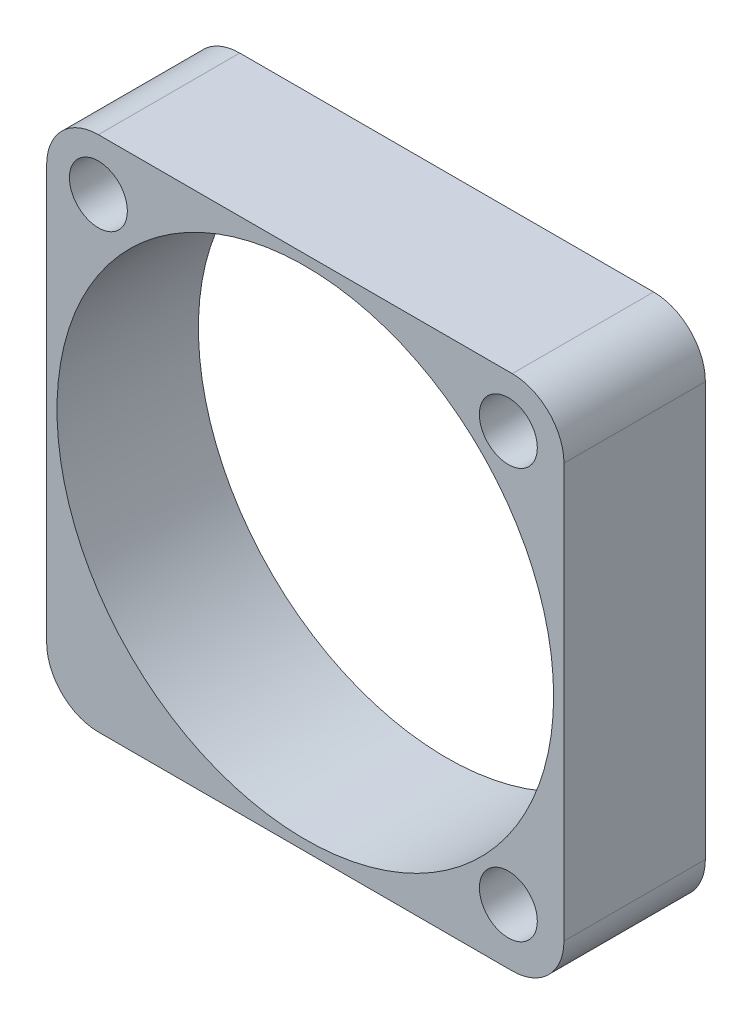
ISO-10303-21;
HEADER;
FILE_DESCRIPTION(('STEP AP214'),'2;1');
FILE_NAME('part.step','',(''),(''),'','','');
FILE_SCHEMA(('AUTOMOTIVE_DESIGN { 1 0 10303 214 1 1 1 1 }'));
ENDSEC;
DATA;
#1=APPLICATION_CONTEXT('core data for automotive mechanical design processes');
#2=APPLICATION_PROTOCOL_DEFINITION('international standard','automotive_design',2000,#1);
#3=PRODUCT_CONTEXT('',#1,'mechanical');
#4=PRODUCT('Part','Part','',(#3));
#5=PRODUCT_RELATED_PRODUCT_CATEGORY('part','',(#4));
#6=PRODUCT_DEFINITION_FORMATION('','',#4);
#7=PRODUCT_DEFINITION_CONTEXT('part definition',#1,'design');
#8=PRODUCT_DEFINITION('design','',#6,#7);
#9=PRODUCT_DEFINITION_SHAPE('','',#8);
#10=(LENGTH_UNIT() NAMED_UNIT(*) SI_UNIT(.MILLI.,.METRE.));
#11=(NAMED_UNIT(*) PLANE_ANGLE_UNIT() SI_UNIT($,.RADIAN.));
#12=(NAMED_UNIT(*) SI_UNIT($,.STERADIAN.) SOLID_ANGLE_UNIT());
#13=UNCERTAINTY_MEASURE_WITH_UNIT(LENGTH_MEASURE(1.E-05),#10,'distance_accuracy_value','');
#14=(GEOMETRIC_REPRESENTATION_CONTEXT(3) GLOBAL_UNCERTAINTY_ASSIGNED_CONTEXT((#13)) GLOBAL_UNIT_ASSIGNED_CONTEXT((#10,
#11,#12)) REPRESENTATION_CONTEXT('',''));
#15=CARTESIAN_POINT('',(0.,0.,0.));
#16=DIRECTION('',(0.,0.,1.));
#17=DIRECTION('',(1.,0.,0.));
#18=AXIS2_PLACEMENT_3D('',#15,#16,#17);
#19=CARTESIAN_POINT('',(0.,0.,6.8325));
#20=DIRECTION('',(1.,0.,0.));
#21=DIRECTION('',(0.,0.,-1.));
#22=AXIS2_PLACEMENT_3D('',#19,#20,#21);
#23=PLANE('',#22);
#24=DIRECTION('',(0.,-1.,0.));
#25=VECTOR('',#24,1.);
#26=CARTESIAN_POINT('',(0.,0.,0.));
#27=LINE('',#26,#25);
#28=CARTESIAN_POINT('',(0.,22.5,0.));
#29=VERTEX_POINT('',#28);
#30=CARTESIAN_POINT('',(0.,2.5,0.));
#31=VERTEX_POINT('',#30);
#32=EDGE_CURVE('E125',#29,#31,#27,.T.);
#33=ORIENTED_EDGE('',*,*,#32,.T.);
#34=DIRECTION('',(0.,0.,-1.));
#35=VECTOR('',#34,1.);
#36=CARTESIAN_POINT('',(0.,2.5,6.8325));
#37=LINE('',#36,#35);
#38=CARTESIAN_POINT('',(0.,2.5,6.8325));
#39=VERTEX_POINT('',#38);
#40=EDGE_CURVE('E103',#31,#39,#37,.F.);
#41=ORIENTED_EDGE('',*,*,#40,.T.);
#42=DIRECTION('',(0.,-1.,0.));
#43=VECTOR('',#42,1.);
#44=CARTESIAN_POINT('',(0.,0.,6.8325));
#45=LINE('',#44,#43);
#46=CARTESIAN_POINT('',(0.,22.5,6.8325));
#47=VERTEX_POINT('',#46);
#48=EDGE_CURVE('E135',#47,#39,#45,.T.);
#49=ORIENTED_EDGE('',*,*,#48,.F.);
#50=DIRECTION('',(0.,0.,-1.));
#51=VECTOR('',#50,1.);
#52=CARTESIAN_POINT('',(0.,22.5,6.8325));
#53=LINE('',#52,#51);
#54=EDGE_CURVE('E108',#47,#29,#53,.T.);
#55=ORIENTED_EDGE('',*,*,#54,.T.);
#56=EDGE_LOOP('',(#33,#41,#49,#55));
#57=FACE_BOUND('',#56,.T.);
#58=ADVANCED_FACE('F32',(#57),#23,.F.);
#59=CARTESIAN_POINT('',(0.,0.,6.8325));
#60=DIRECTION('',(0.,1.,0.));
#61=DIRECTION('',(0.,0.,1.));
#62=AXIS2_PLACEMENT_3D('',#59,#60,#61);
#63=PLANE('',#62);
#64=DIRECTION('',(1.,0.,0.));
#65=VECTOR('',#64,1.);
#66=CARTESIAN_POINT('',(0.,0.,6.8325));
#67=LINE('',#66,#65);
#68=CARTESIAN_POINT('',(2.5,0.,6.8325));
#69=VERTEX_POINT('',#68);
#70=CARTESIAN_POINT('',(22.5,0.,6.8325));
#71=VERTEX_POINT('',#70);
#72=EDGE_CURVE('E118',#69,#71,#67,.T.);
#73=ORIENTED_EDGE('',*,*,#72,.F.);
#74=DIRECTION('',(0.,0.,-1.));
#75=VECTOR('',#74,1.);
#76=CARTESIAN_POINT('',(2.5,0.,6.8325));
#77=LINE('',#76,#75);
#78=CARTESIAN_POINT('',(2.5,0.,0.));
#79=VERTEX_POINT('',#78);
#80=EDGE_CURVE('E102',#69,#79,#77,.T.);
#81=ORIENTED_EDGE('',*,*,#80,.T.);
#82=DIRECTION('',(1.,0.,0.));
#83=VECTOR('',#82,1.);
#84=CARTESIAN_POINT('',(0.,0.,0.));
#85=LINE('',#84,#83);
#86=CARTESIAN_POINT('',(22.5,0.,0.));
#87=VERTEX_POINT('',#86);
#88=EDGE_CURVE('E115',#79,#87,#85,.T.);
#89=ORIENTED_EDGE('',*,*,#88,.T.);
#90=DIRECTION('',(0.,0.,-1.));
#91=VECTOR('',#90,1.);
#92=CARTESIAN_POINT('',(22.5,0.,6.8325));
#93=LINE('',#92,#91);
#94=EDGE_CURVE('E120',#87,#71,#93,.F.);
#95=ORIENTED_EDGE('',*,*,#94,.T.);
#96=EDGE_LOOP('',(#73,#81,#89,#95));
#97=FACE_BOUND('',#96,.T.);
#98=ADVANCED_FACE('F114',(#97),#63,.F.);
#99=CARTESIAN_POINT('',(25.,0.,6.8325));
#100=DIRECTION('',(-1.,0.,0.));
#101=DIRECTION('',(0.,0.,1.));
#102=AXIS2_PLACEMENT_3D('',#99,#100,#101);
#103=PLANE('',#102);
#104=DIRECTION('',(0.,1.,0.));
#105=VECTOR('',#104,1.);
#106=CARTESIAN_POINT('',(25.,0.,6.8325));
#107=LINE('',#106,#105);
#108=CARTESIAN_POINT('',(25.,2.5,6.8325));
#109=VERTEX_POINT('',#108);
#110=CARTESIAN_POINT('',(25.,22.5,6.8325));
#111=VERTEX_POINT('',#110);
#112=EDGE_CURVE('E161',#109,#111,#107,.T.);
#113=ORIENTED_EDGE('',*,*,#112,.F.);
#114=DIRECTION('',(0.,0.,-1.));
#115=VECTOR('',#114,1.);
#116=CARTESIAN_POINT('',(25.,2.5,6.8325));
#117=LINE('',#116,#115);
#118=CARTESIAN_POINT('',(25.,2.5,0.));
#119=VERTEX_POINT('',#118);
#120=EDGE_CURVE('E154',#109,#119,#117,.T.);
#121=ORIENTED_EDGE('',*,*,#120,.T.);
#122=DIRECTION('',(0.,1.,0.));
#123=VECTOR('',#122,1.);
#124=CARTESIAN_POINT('',(25.,0.,0.));
#125=LINE('',#124,#123);
#126=CARTESIAN_POINT('',(25.,22.5,0.));
#127=VERTEX_POINT('',#126);
#128=EDGE_CURVE('E124',#119,#127,#125,.T.);
#129=ORIENTED_EDGE('',*,*,#128,.T.);
#130=DIRECTION('',(0.,0.,-1.));
#131=VECTOR('',#130,1.);
#132=CARTESIAN_POINT('',(25.,22.5,6.8325));
#133=LINE('',#132,#131);
#134=EDGE_CURVE('E152',#127,#111,#133,.F.);
#135=ORIENTED_EDGE('',*,*,#134,.T.);
#136=EDGE_LOOP('',(#113,#121,#129,#135));
#137=FACE_BOUND('',#136,.T.);
#138=ADVANCED_FACE('F159',(#137),#103,.F.);
#139=CARTESIAN_POINT('',(0.,25.,6.8325));
#140=DIRECTION('',(0.,-1.,0.));
#141=DIRECTION('',(0.,0.,-1.));
#142=AXIS2_PLACEMENT_3D('',#139,#140,#141);
#143=PLANE('',#142);
#144=DIRECTION('',(-1.,0.,0.));
#145=VECTOR('',#144,1.);
#146=CARTESIAN_POINT('',(0.,25.,6.8325));
#147=LINE('',#146,#145);
#148=CARTESIAN_POINT('',(22.5,25.,6.8325));
#149=VERTEX_POINT('',#148);
#150=CARTESIAN_POINT('',(2.5,25.,6.8325));
#151=VERTEX_POINT('',#150);
#152=EDGE_CURVE('E136',#149,#151,#147,.T.);
#153=ORIENTED_EDGE('',*,*,#152,.F.);
#154=DIRECTION('',(0.,0.,-1.));
#155=VECTOR('',#154,1.);
#156=CARTESIAN_POINT('',(22.5,25.,6.8325));
#157=LINE('',#156,#155);
#158=CARTESIAN_POINT('',(22.5,25.,0.));
#159=VERTEX_POINT('',#158);
#160=EDGE_CURVE('E11',#149,#159,#157,.T.);
#161=ORIENTED_EDGE('',*,*,#160,.T.);
#162=DIRECTION('',(-1.,0.,0.));
#163=VECTOR('',#162,1.);
#164=CARTESIAN_POINT('',(0.,25.,0.));
#165=LINE('',#164,#163);
#166=CARTESIAN_POINT('',(2.5,25.,0.));
#167=VERTEX_POINT('',#166);
#168=EDGE_CURVE('E128',#159,#167,#165,.T.);
#169=ORIENTED_EDGE('',*,*,#168,.T.);
#170=DIRECTION('',(0.,0.,-1.));
#171=VECTOR('',#170,1.);
#172=CARTESIAN_POINT('',(2.5,25.,6.8325));
#173=LINE('',#172,#171);
#174=EDGE_CURVE('E40',#167,#151,#173,.F.);
#175=ORIENTED_EDGE('',*,*,#174,.T.);
#176=EDGE_LOOP('',(#153,#161,#169,#175));
#177=FACE_BOUND('',#176,.T.);
#178=ADVANCED_FACE('F168',(#177),#143,.F.);
#179=CARTESIAN_POINT('',(0.,0.,6.8325));
#180=DIRECTION('',(0.,0.,-1.));
#181=DIRECTION('',(-1.,0.,0.));
#182=AXIS2_PLACEMENT_3D('',#179,#180,#181);
#183=PLANE('',#182);
#184=CARTESIAN_POINT('',(22.312,2.68799999999999,6.8325));
#185=DIRECTION('',(0.,0.,1.));
#186=DIRECTION('',(1.,0.,0.));
#187=AXIS2_PLACEMENT_3D('',#184,#185,#186);
#188=CIRCLE('',#187,1.4);
#189=CARTESIAN_POINT('',(23.712,2.68799999999999,6.8325));
#190=VERTEX_POINT('',#189);
#191=EDGE_CURVE('E193',#190,#190,#188,.T.);
#192=ORIENTED_EDGE('',*,*,#191,.F.);
#193=EDGE_LOOP('',(#192));
#194=FACE_BOUND('',#193,.T.);
#195=CARTESIAN_POINT('',(22.312,22.5,6.8325));
#196=DIRECTION('',(0.,0.,1.));
#197=DIRECTION('',(1.,0.,0.));
#198=AXIS2_PLACEMENT_3D('',#195,#196,#197);
#199=CIRCLE('',#198,1.4);
#200=CARTESIAN_POINT('',(23.712,22.5,6.8325));
#201=VERTEX_POINT('',#200);
#202=EDGE_CURVE('E187',#201,#201,#199,.T.);
#203=ORIENTED_EDGE('',*,*,#202,.F.);
#204=EDGE_LOOP('',(#203));
#205=FACE_BOUND('',#204,.T.);
#206=CARTESIAN_POINT('',(2.5,22.5,6.8325));
#207=DIRECTION('',(0.,0.,1.));
#208=DIRECTION('',(1.,0.,0.));
#209=AXIS2_PLACEMENT_3D('',#206,#207,#208);
#210=CIRCLE('',#209,1.4);
#211=CARTESIAN_POINT('',(3.9,22.5,6.8325));
#212=VERTEX_POINT('',#211);
#213=EDGE_CURVE('E181',#212,#212,#210,.T.);
#214=ORIENTED_EDGE('',*,*,#213,.F.);
#215=EDGE_LOOP('',(#214));
#216=FACE_BOUND('',#215,.T.);
#217=CARTESIAN_POINT('',(12.5,12.5,6.8325));
#218=DIRECTION('',(0.,0.,1.));
#219=DIRECTION('',(1.,0.,0.));
#220=AXIS2_PLACEMENT_3D('',#217,#218,#219);
#221=CIRCLE('',#220,12.);
#222=CARTESIAN_POINT('',(24.5,12.5,6.8325));
#223=VERTEX_POINT('',#222);
#224=EDGE_CURVE('E175',#223,#223,#221,.T.);
#225=ORIENTED_EDGE('',*,*,#224,.F.);
#226=EDGE_LOOP('',(#225));
#227=FACE_BOUND('',#226,.T.);
#228=ORIENTED_EDGE('',*,*,#48,.T.);
#229=CARTESIAN_POINT('',(2.5,2.5,6.8325));
#230=DIRECTION('',(0.,0.,-1.));
#231=DIRECTION('',(-1.,0.,0.));
#232=AXIS2_PLACEMENT_3D('',#229,#230,#231);
#233=CIRCLE('',#232,2.5);
#234=EDGE_CURVE('E150',#39,#69,#233,.F.);
#235=ORIENTED_EDGE('',*,*,#234,.T.);
#236=ORIENTED_EDGE('',*,*,#72,.T.);
#237=CARTESIAN_POINT('',(22.5,2.5,6.8325));
#238=DIRECTION('',(0.,0.,-1.));
#239=DIRECTION('',(-1.,0.,0.));
#240=AXIS2_PLACEMENT_3D('',#237,#238,#239);
#241=CIRCLE('',#240,2.5);
#242=EDGE_CURVE('E148',#71,#109,#241,.F.);
#243=ORIENTED_EDGE('',*,*,#242,.T.);
#244=ORIENTED_EDGE('',*,*,#112,.T.);
#245=CARTESIAN_POINT('',(22.5,22.5,6.8325));
#246=DIRECTION('',(0.,0.,-1.));
#247=DIRECTION('',(-1.,0.,0.));
#248=AXIS2_PLACEMENT_3D('',#245,#246,#247);
#249=CIRCLE('',#248,2.5);
#250=EDGE_CURVE('E53',#111,#149,#249,.F.);
#251=ORIENTED_EDGE('',*,*,#250,.T.);
#252=ORIENTED_EDGE('',*,*,#152,.T.);
#253=CARTESIAN_POINT('',(2.5,22.5,6.8325));
#254=DIRECTION('',(0.,0.,-1.));
#255=DIRECTION('',(-1.,0.,0.));
#256=AXIS2_PLACEMENT_3D('',#253,#254,#255);
#257=CIRCLE('',#256,2.5);
#258=EDGE_CURVE('E145',#151,#47,#257,.F.);
#259=ORIENTED_EDGE('',*,*,#258,.T.);
#260=EDGE_LOOP('',(#228,#235,#236,#243,#244,#251,#252,#259));
#261=FACE_BOUND('',#260,.T.);
#262=ADVANCED_FACE('F208',(#194,#205,#216,#227,#261),#183,.F.);
#263=CARTESIAN_POINT('',(0.,0.,0.));
#264=DIRECTION('',(0.,0.,-1.));
#265=DIRECTION('',(-1.,0.,0.));
#266=AXIS2_PLACEMENT_3D('',#263,#264,#265);
#267=PLANE('',#266);
#268=CARTESIAN_POINT('',(22.312,2.68799999999999,0.));
#269=DIRECTION('',(0.,0.,1.));
#270=DIRECTION('',(1.,0.,0.));
#271=AXIS2_PLACEMENT_3D('',#268,#269,#270);
#272=CIRCLE('',#271,1.4);
#273=CARTESIAN_POINT('',(23.712,2.68799999999999,0.));
#274=VERTEX_POINT('',#273);
#275=EDGE_CURVE('E190',#274,#274,#272,.T.);
#276=ORIENTED_EDGE('',*,*,#275,.T.);
#277=EDGE_LOOP('',(#276));
#278=FACE_BOUND('',#277,.T.);
#279=CARTESIAN_POINT('',(22.312,22.5,0.));
#280=DIRECTION('',(0.,0.,1.));
#281=DIRECTION('',(1.,0.,0.));
#282=AXIS2_PLACEMENT_3D('',#279,#280,#281);
#283=CIRCLE('',#282,1.4);
#284=CARTESIAN_POINT('',(23.712,22.5,0.));
#285=VERTEX_POINT('',#284);
#286=EDGE_CURVE('E184',#285,#285,#283,.T.);
#287=ORIENTED_EDGE('',*,*,#286,.T.);
#288=EDGE_LOOP('',(#287));
#289=FACE_BOUND('',#288,.T.);
#290=CARTESIAN_POINT('',(2.5,22.5,0.));
#291=DIRECTION('',(0.,0.,1.));
#292=DIRECTION('',(1.,0.,0.));
#293=AXIS2_PLACEMENT_3D('',#290,#291,#292);
#294=CIRCLE('',#293,1.4);
#295=CARTESIAN_POINT('',(3.9,22.5,0.));
#296=VERTEX_POINT('',#295);
#297=EDGE_CURVE('E178',#296,#296,#294,.T.);
#298=ORIENTED_EDGE('',*,*,#297,.T.);
#299=EDGE_LOOP('',(#298));
#300=FACE_BOUND('',#299,.T.);
#301=CARTESIAN_POINT('',(12.5,12.5,0.));
#302=DIRECTION('',(0.,0.,1.));
#303=DIRECTION('',(1.,0.,0.));
#304=AXIS2_PLACEMENT_3D('',#301,#302,#303);
#305=CIRCLE('',#304,12.);
#306=CARTESIAN_POINT('',(24.5,12.5,0.));
#307=VERTEX_POINT('',#306);
#308=EDGE_CURVE('E130',#307,#307,#305,.T.);
#309=ORIENTED_EDGE('',*,*,#308,.T.);
#310=EDGE_LOOP('',(#309));
#311=FACE_BOUND('',#310,.T.);
#312=ORIENTED_EDGE('',*,*,#88,.F.);
#313=CARTESIAN_POINT('',(2.5,2.5,0.));
#314=DIRECTION('',(0.,0.,-1.));
#315=DIRECTION('',(-1.,0.,0.));
#316=AXIS2_PLACEMENT_3D('',#313,#314,#315);
#317=CIRCLE('',#316,2.5);
#318=EDGE_CURVE('E98',#79,#31,#317,.T.);
#319=ORIENTED_EDGE('',*,*,#318,.T.);
#320=ORIENTED_EDGE('',*,*,#32,.F.);
#321=CARTESIAN_POINT('',(2.5,22.5,0.));
#322=DIRECTION('',(0.,0.,-1.));
#323=DIRECTION('',(-1.,0.,0.));
#324=AXIS2_PLACEMENT_3D('',#321,#322,#323);
#325=CIRCLE('',#324,2.5);
#326=EDGE_CURVE('E119',#29,#167,#325,.T.);
#327=ORIENTED_EDGE('',*,*,#326,.T.);
#328=ORIENTED_EDGE('',*,*,#168,.F.);
#329=CARTESIAN_POINT('',(22.5,22.5,0.));
#330=DIRECTION('',(0.,0.,-1.));
#331=DIRECTION('',(-1.,0.,0.));
#332=AXIS2_PLACEMENT_3D('',#329,#330,#331);
#333=CIRCLE('',#332,2.5);
#334=EDGE_CURVE('E139',#159,#127,#333,.T.);
#335=ORIENTED_EDGE('',*,*,#334,.T.);
#336=ORIENTED_EDGE('',*,*,#128,.F.);
#337=CARTESIAN_POINT('',(22.5,2.5,0.));
#338=DIRECTION('',(0.,0.,-1.));
#339=DIRECTION('',(-1.,0.,0.));
#340=AXIS2_PLACEMENT_3D('',#337,#338,#339);
#341=CIRCLE('',#340,2.5);
#342=EDGE_CURVE('E109',#119,#87,#341,.T.);
#343=ORIENTED_EDGE('',*,*,#342,.T.);
#344=EDGE_LOOP('',(#312,#319,#320,#327,#328,#335,#336,#343));
#345=FACE_BOUND('',#344,.T.);
#346=ADVANCED_FACE('F122',(#278,#289,#300,#311,#345),#267,.T.);
#347=CARTESIAN_POINT('',(12.5,12.5,0.));
#348=DIRECTION('',(0.,0.,1.));
#349=DIRECTION('',(1.,0.,0.));
#350=AXIS2_PLACEMENT_3D('',#347,#348,#349);
#351=CYLINDRICAL_SURFACE('',#350,12.);
#352=ORIENTED_EDGE('',*,*,#308,.F.);
#353=EDGE_LOOP('',(#352));
#354=FACE_BOUND('',#353,.T.);
#355=ORIENTED_EDGE('',*,*,#224,.T.);
#356=EDGE_LOOP('',(#355));
#357=FACE_BOUND('',#356,.T.);
#358=ADVANCED_FACE('F280',(#354,#357),#351,.F.);
#359=CARTESIAN_POINT('',(2.5,22.5,0.));
#360=DIRECTION('',(0.,0.,1.));
#361=DIRECTION('',(1.,0.,0.));
#362=AXIS2_PLACEMENT_3D('',#359,#360,#361);
#363=CYLINDRICAL_SURFACE('',#362,1.4);
#364=ORIENTED_EDGE('',*,*,#297,.F.);
#365=EDGE_LOOP('',(#364));
#366=FACE_BOUND('',#365,.T.);
#367=ORIENTED_EDGE('',*,*,#213,.T.);
#368=EDGE_LOOP('',(#367));
#369=FACE_BOUND('',#368,.T.);
#370=ADVANCED_FACE('F271',(#366,#369),#363,.F.);
#371=CARTESIAN_POINT('',(22.312,22.5,0.));
#372=DIRECTION('',(0.,0.,1.));
#373=DIRECTION('',(1.,0.,0.));
#374=AXIS2_PLACEMENT_3D('',#371,#372,#373);
#375=CYLINDRICAL_SURFACE('',#374,1.4);
#376=ORIENTED_EDGE('',*,*,#286,.F.);
#377=EDGE_LOOP('',(#376));
#378=FACE_BOUND('',#377,.T.);
#379=ORIENTED_EDGE('',*,*,#202,.T.);
#380=EDGE_LOOP('',(#379));
#381=FACE_BOUND('',#380,.T.);
#382=ADVANCED_FACE('F204',(#378,#381),#375,.F.);
#383=CARTESIAN_POINT('',(22.312,2.68799999999999,0.));
#384=DIRECTION('',(0.,0.,1.));
#385=DIRECTION('',(1.,0.,0.));
#386=AXIS2_PLACEMENT_3D('',#383,#384,#385);
#387=CYLINDRICAL_SURFACE('',#386,1.4);
#388=ORIENTED_EDGE('',*,*,#275,.F.);
#389=EDGE_LOOP('',(#388));
#390=FACE_BOUND('',#389,.T.);
#391=ORIENTED_EDGE('',*,*,#191,.T.);
#392=EDGE_LOOP('',(#391));
#393=FACE_BOUND('',#392,.T.);
#394=ADVANCED_FACE('F201',(#390,#393),#387,.F.);
#395=CARTESIAN_POINT('',(2.5,2.5,6.8325));
#396=DIRECTION('',(0.,0.,-1.));
#397=DIRECTION('',(-1.,0.,0.));
#398=AXIS2_PLACEMENT_3D('',#395,#396,#397);
#399=CYLINDRICAL_SURFACE('',#398,2.5);
#400=ORIENTED_EDGE('',*,*,#234,.F.);
#401=ORIENTED_EDGE('',*,*,#40,.F.);
#402=ORIENTED_EDGE('',*,*,#318,.F.);
#403=ORIENTED_EDGE('',*,*,#80,.F.);
#404=EDGE_LOOP('',(#400,#401,#402,#403));
#405=FACE_BOUND('',#404,.T.);
#406=ADVANCED_FACE('F101',(#405),#399,.T.);
#407=CARTESIAN_POINT('',(22.5,2.5,6.8325));
#408=DIRECTION('',(0.,0.,-1.));
#409=DIRECTION('',(-1.,0.,0.));
#410=AXIS2_PLACEMENT_3D('',#407,#408,#409);
#411=CYLINDRICAL_SURFACE('',#410,2.5);
#412=ORIENTED_EDGE('',*,*,#242,.F.);
#413=ORIENTED_EDGE('',*,*,#94,.F.);
#414=ORIENTED_EDGE('',*,*,#342,.F.);
#415=ORIENTED_EDGE('',*,*,#120,.F.);
#416=EDGE_LOOP('',(#412,#413,#414,#415));
#417=FACE_BOUND('',#416,.T.);
#418=ADVANCED_FACE('F225',(#417),#411,.T.);
#419=CARTESIAN_POINT('',(22.5,22.5,6.8325));
#420=DIRECTION('',(0.,0.,-1.));
#421=DIRECTION('',(-1.,0.,0.));
#422=AXIS2_PLACEMENT_3D('',#419,#420,#421);
#423=CYLINDRICAL_SURFACE('',#422,2.5);
#424=ORIENTED_EDGE('',*,*,#250,.F.);
#425=ORIENTED_EDGE('',*,*,#134,.F.);
#426=ORIENTED_EDGE('',*,*,#334,.F.);
#427=ORIENTED_EDGE('',*,*,#160,.F.);
#428=EDGE_LOOP('',(#424,#425,#426,#427));
#429=FACE_BOUND('',#428,.T.);
#430=ADVANCED_FACE('F167',(#429),#423,.T.);
#431=CARTESIAN_POINT('',(2.5,22.5,6.8325));
#432=DIRECTION('',(0.,0.,-1.));
#433=DIRECTION('',(-1.,0.,0.));
#434=AXIS2_PLACEMENT_3D('',#431,#432,#433);
#435=CYLINDRICAL_SURFACE('',#434,2.5);
#436=ORIENTED_EDGE('',*,*,#258,.F.);
#437=ORIENTED_EDGE('',*,*,#174,.F.);
#438=ORIENTED_EDGE('',*,*,#326,.F.);
#439=ORIENTED_EDGE('',*,*,#54,.F.);
#440=EDGE_LOOP('',(#436,#437,#438,#439));
#441=FACE_BOUND('',#440,.T.);
#442=ADVANCED_FACE('F34',(#441),#435,.T.);
#443=CLOSED_SHELL('',(#58,#98,#138,#178,#262,#346,#358,#370,#382,#394,#406,#418,#430,#442));
#444=MANIFOLD_SOLID_BREP('B2',#443);
#445=ADVANCED_BREP_SHAPE_REPRESENTATION('',(#18,#444),#14);
#446=SHAPE_DEFINITION_REPRESENTATION(#9,#445);
ENDSEC;
END-ISO-10303-21;
